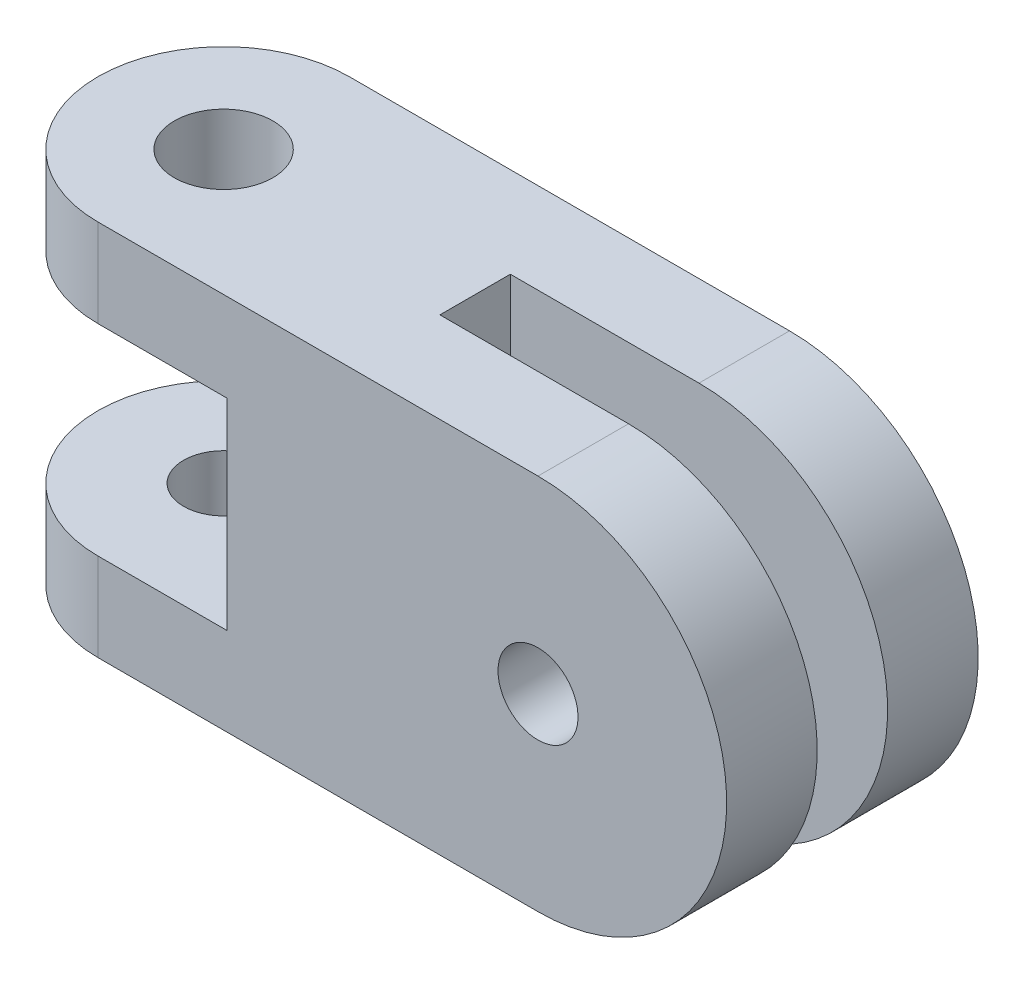
ISO-10303-21;
HEADER;
FILE_DESCRIPTION(('STEP AP214'),'2;1');
FILE_NAME('part.step','',(''),(''),'','','');
FILE_SCHEMA(('AUTOMOTIVE_DESIGN { 1 0 10303 214 1 1 1 1 }'));
ENDSEC;
DATA;
#1=APPLICATION_CONTEXT('core data for automotive mechanical design processes');
#2=APPLICATION_PROTOCOL_DEFINITION('international standard','automotive_design',2000,#1);
#3=PRODUCT_CONTEXT('',#1,'mechanical');
#4=PRODUCT('Part','Part','',(#3));
#5=PRODUCT_RELATED_PRODUCT_CATEGORY('part','',(#4));
#6=PRODUCT_DEFINITION_FORMATION('','',#4);
#7=PRODUCT_DEFINITION_CONTEXT('part definition',#1,'design');
#8=PRODUCT_DEFINITION('design','',#6,#7);
#9=PRODUCT_DEFINITION_SHAPE('','',#8);
#10=(LENGTH_UNIT() NAMED_UNIT(*) SI_UNIT(.MILLI.,.METRE.));
#11=(NAMED_UNIT(*) PLANE_ANGLE_UNIT() SI_UNIT($,.RADIAN.));
#12=(NAMED_UNIT(*) SI_UNIT($,.STERADIAN.) SOLID_ANGLE_UNIT());
#13=UNCERTAINTY_MEASURE_WITH_UNIT(LENGTH_MEASURE(1.E-05),#10,'distance_accuracy_value','');
#14=(GEOMETRIC_REPRESENTATION_CONTEXT(3) GLOBAL_UNCERTAINTY_ASSIGNED_CONTEXT((#13)) GLOBAL_UNIT_ASSIGNED_CONTEXT((#10,
#11,#12)) REPRESENTATION_CONTEXT('',''));
#15=CARTESIAN_POINT('',(0.,0.,0.));
#16=DIRECTION('',(0.,0.,1.));
#17=DIRECTION('',(1.,0.,0.));
#18=AXIS2_PLACEMENT_3D('',#15,#16,#17);
#19=CARTESIAN_POINT('',(6.35,0.,-38.1));
#20=DIRECTION('',(0.,0.,1.));
#21=DIRECTION('',(1.,0.,0.));
#22=AXIS2_PLACEMENT_3D('',#19,#20,#21);
#23=CYLINDRICAL_SURFACE('',#22,9.525);
#24=DIRECTION('',(0.,0.,1.));
#25=VECTOR('',#24,1.);
#26=CARTESIAN_POINT('',(6.35,9.525,-38.1));
#27=LINE('',#26,#25);
#28=CARTESIAN_POINT('',(6.35,9.525,-6.35));
#29=VERTEX_POINT('',#28);
#30=CARTESIAN_POINT('',(6.35,9.525,-1.778));
#31=VERTEX_POINT('',#30);
#32=EDGE_CURVE('E192',#29,#31,#27,.T.);
#33=ORIENTED_EDGE('',*,*,#32,.T.);
#34=CARTESIAN_POINT('',(6.35,0.,-1.778));
#35=DIRECTION('',(0.,0.,1.));
#36=DIRECTION('',(1.,0.,0.));
#37=AXIS2_PLACEMENT_3D('',#34,#35,#36);
#38=CIRCLE('',#37,9.525);
#39=CARTESIAN_POINT('',(6.35,-9.525,-1.778));
#40=VERTEX_POINT('',#39);
#41=EDGE_CURVE('E254',#40,#31,#38,.T.);
#42=ORIENTED_EDGE('',*,*,#41,.F.);
#43=DIRECTION('',(0.,0.,1.));
#44=VECTOR('',#43,1.);
#45=CARTESIAN_POINT('',(6.35,-9.525,-38.1));
#46=LINE('',#45,#44);
#47=CARTESIAN_POINT('',(6.35,-9.525,-6.35));
#48=VERTEX_POINT('',#47);
#49=EDGE_CURVE('E199',#48,#40,#46,.T.);
#50=ORIENTED_EDGE('',*,*,#49,.F.);
#51=CARTESIAN_POINT('',(6.35,0.,-6.35));
#52=DIRECTION('',(0.,0.,1.));
#53=DIRECTION('',(1.,0.,0.));
#54=AXIS2_PLACEMENT_3D('',#51,#52,#53);
#55=CIRCLE('',#54,9.525);
#56=EDGE_CURVE('E188',#29,#48,#55,.F.);
#57=ORIENTED_EDGE('',*,*,#56,.F.);
#58=EDGE_LOOP('',(#33,#42,#50,#57));
#59=FACE_BOUND('',#58,.T.);
#60=ADVANCED_FACE('F35',(#59),#23,.T.);
#61=CARTESIAN_POINT('',(0.,9.525,-6.35));
#62=DIRECTION('',(0.,0.,1.));
#63=DIRECTION('',(1.,0.,0.));
#64=AXIS2_PLACEMENT_3D('',#61,#62,#63);
#65=PLANE('',#64);
#66=CARTESIAN_POINT('',(6.35,0.,-6.35));
#67=DIRECTION('',(0.,0.,-1.));
#68=DIRECTION('',(-1.,0.,0.));
#69=AXIS2_PLACEMENT_3D('',#66,#67,#68);
#70=CIRCLE('',#69,2.48919999999999);
#71=CARTESIAN_POINT('',(3.86080000000001,0.,-6.35));
#72=VERTEX_POINT('',#71);
#73=EDGE_CURVE('E267',#72,#72,#70,.T.);
#74=ORIENTED_EDGE('',*,*,#73,.F.);
#75=EDGE_LOOP('',(#74));
#76=FACE_BOUND('',#75,.T.);
#77=DIRECTION('',(-1.,0.,0.));
#78=VECTOR('',#77,1.);
#79=CARTESIAN_POINT('',(-9.351499966,-5.08,-6.35));
#80=LINE('',#79,#78);
#81=CARTESIAN_POINT('',(-9.351499966,-5.08,-6.35));
#82=VERTEX_POINT('',#81);
#83=CARTESIAN_POINT('',(-15.875,-5.08,-6.35));
#84=VERTEX_POINT('',#83);
#85=EDGE_CURVE('E172',#82,#84,#80,.T.);
#86=ORIENTED_EDGE('',*,*,#85,.F.);
#87=DIRECTION('',(0.,1.,0.));
#88=VECTOR('',#87,1.);
#89=CARTESIAN_POINT('',(-9.351499966,-5.08,-6.35));
#90=LINE('',#89,#88);
#91=CARTESIAN_POINT('',(-9.351499966,5.08,-6.35));
#92=VERTEX_POINT('',#91);
#93=EDGE_CURVE('E183',#82,#92,#90,.T.);
#94=ORIENTED_EDGE('',*,*,#93,.T.);
#95=DIRECTION('',(-1.,0.,0.));
#96=VECTOR('',#95,1.);
#97=CARTESIAN_POINT('',(-9.351499966,5.08,-6.35));
#98=LINE('',#97,#96);
#99=CARTESIAN_POINT('',(-15.875,5.08,-6.35));
#100=VERTEX_POINT('',#99);
#101=EDGE_CURVE('E166',#92,#100,#98,.T.);
#102=ORIENTED_EDGE('',*,*,#101,.T.);
#103=DIRECTION('',(0.,-1.,0.));
#104=VECTOR('',#103,1.);
#105=CARTESIAN_POINT('',(-15.875,9.525,-6.35));
#106=LINE('',#105,#104);
#107=CARTESIAN_POINT('',(-15.875,9.525,-6.35));
#108=VERTEX_POINT('',#107);
#109=EDGE_CURVE('E11',#108,#100,#106,.T.);
#110=ORIENTED_EDGE('',*,*,#109,.F.);
#111=DIRECTION('',(-1.,0.,0.));
#112=VECTOR('',#111,1.);
#113=CARTESIAN_POINT('',(0.,9.525,-6.35));
#114=LINE('',#113,#112);
#115=EDGE_CURVE('E201',#29,#108,#114,.T.);
#116=ORIENTED_EDGE('',*,*,#115,.F.);
#117=ORIENTED_EDGE('',*,*,#56,.T.);
#118=DIRECTION('',(-1.,0.,0.));
#119=VECTOR('',#118,1.);
#120=CARTESIAN_POINT('',(0.,-9.525,-6.35));
#121=LINE('',#120,#119);
#122=CARTESIAN_POINT('',(-15.875,-9.525,-6.35));
#123=VERTEX_POINT('',#122);
#124=EDGE_CURVE('E191',#48,#123,#121,.T.);
#125=ORIENTED_EDGE('',*,*,#124,.T.);
#126=EDGE_CURVE('E43',#84,#123,#106,.T.);
#127=ORIENTED_EDGE('',*,*,#126,.F.);
#128=EDGE_LOOP('',(#86,#94,#102,#110,#116,#117,#125,#127));
#129=FACE_BOUND('',#128,.T.);
#130=ADVANCED_FACE('F37',(#76,#129),#65,.F.);
#131=CARTESIAN_POINT('',(-15.875,9.525,0.));
#132=DIRECTION('',(0.,-1.,0.));
#133=DIRECTION('',(0.,0.,-1.));
#134=AXIS2_PLACEMENT_3D('',#131,#132,#133);
#135=CYLINDRICAL_SURFACE('',#134,6.35);
#136=CARTESIAN_POINT('',(-15.875,-5.08,0.));
#137=DIRECTION('',(0.,1.,0.));
#138=DIRECTION('',(0.,0.,1.));
#139=AXIS2_PLACEMENT_3D('',#136,#137,#138);
#140=CIRCLE('',#139,6.35);
#141=CARTESIAN_POINT('',(-15.875,-5.08,6.35));
#142=VERTEX_POINT('',#141);
#143=EDGE_CURVE('E163',#84,#142,#140,.T.);
#144=ORIENTED_EDGE('',*,*,#143,.F.);
#145=ORIENTED_EDGE('',*,*,#126,.T.);
#146=CARTESIAN_POINT('',(-15.875,-9.525,0.));
#147=DIRECTION('',(0.,1.,0.));
#148=DIRECTION('',(0.,0.,1.));
#149=AXIS2_PLACEMENT_3D('',#146,#147,#148);
#150=CIRCLE('',#149,6.35);
#151=CARTESIAN_POINT('',(-15.875,-9.525,6.35));
#152=VERTEX_POINT('',#151);
#153=EDGE_CURVE('E212',#123,#152,#150,.T.);
#154=ORIENTED_EDGE('',*,*,#153,.T.);
#155=DIRECTION('',(0.,-1.,0.));
#156=VECTOR('',#155,1.);
#157=CARTESIAN_POINT('',(-15.875,9.525,6.35));
#158=LINE('',#157,#156);
#159=EDGE_CURVE('E209',#142,#152,#158,.T.);
#160=ORIENTED_EDGE('',*,*,#159,.F.);
#161=EDGE_LOOP('',(#144,#145,#154,#160));
#162=FACE_BOUND('',#161,.T.);
#163=ADVANCED_FACE('F230',(#162),#135,.T.);
#164=CARTESIAN_POINT('',(0.,9.525,6.35));
#165=DIRECTION('',(0.,0.,-1.));
#166=DIRECTION('',(-1.,0.,0.));
#167=AXIS2_PLACEMENT_3D('',#164,#165,#166);
#168=PLANE('',#167);
#169=CARTESIAN_POINT('',(6.35,0.,6.35));
#170=DIRECTION('',(0.,0.,-1.));
#171=DIRECTION('',(-1.,0.,0.));
#172=AXIS2_PLACEMENT_3D('',#169,#170,#171);
#173=CIRCLE('',#172,2.0193);
#174=CARTESIAN_POINT('',(4.3307,0.,6.35));
#175=VERTEX_POINT('',#174);
#176=EDGE_CURVE('E270',#175,#175,#173,.T.);
#177=ORIENTED_EDGE('',*,*,#176,.T.);
#178=EDGE_LOOP('',(#177));
#179=FACE_BOUND('',#178,.T.);
#180=DIRECTION('',(1.,0.,0.));
#181=VECTOR('',#180,1.);
#182=CARTESIAN_POINT('',(-15.875,-5.08,6.35));
#183=LINE('',#182,#181);
#184=CARTESIAN_POINT('',(-9.351499966,-5.08,6.35));
#185=VERTEX_POINT('',#184);
#186=EDGE_CURVE('E165',#142,#185,#183,.T.);
#187=ORIENTED_EDGE('',*,*,#186,.F.);
#188=ORIENTED_EDGE('',*,*,#159,.T.);
#189=DIRECTION('',(1.,0.,0.));
#190=VECTOR('',#189,1.);
#191=CARTESIAN_POINT('',(0.,-9.525,6.35));
#192=LINE('',#191,#190);
#193=CARTESIAN_POINT('',(6.35,-9.525,6.35));
#194=VERTEX_POINT('',#193);
#195=EDGE_CURVE('E204',#152,#194,#192,.T.);
#196=ORIENTED_EDGE('',*,*,#195,.T.);
#197=CARTESIAN_POINT('',(6.35,0.,6.35));
#198=DIRECTION('',(0.,0.,1.));
#199=DIRECTION('',(1.,0.,0.));
#200=AXIS2_PLACEMENT_3D('',#197,#198,#199);
#201=CIRCLE('',#200,9.525);
#202=CARTESIAN_POINT('',(6.35,9.525,6.35));
#203=VERTEX_POINT('',#202);
#204=EDGE_CURVE('E186',#194,#203,#201,.T.);
#205=ORIENTED_EDGE('',*,*,#204,.T.);
#206=DIRECTION('',(1.,0.,0.));
#207=VECTOR('',#206,1.);
#208=CARTESIAN_POINT('',(0.,9.525,6.35));
#209=LINE('',#208,#207);
#210=CARTESIAN_POINT('',(-15.875,9.525,6.35));
#211=VERTEX_POINT('',#210);
#212=EDGE_CURVE('E206',#211,#203,#209,.T.);
#213=ORIENTED_EDGE('',*,*,#212,.F.);
#214=CARTESIAN_POINT('',(-15.875,5.08,6.35));
#215=VERTEX_POINT('',#214);
#216=EDGE_CURVE('E216',#211,#215,#158,.T.);
#217=ORIENTED_EDGE('',*,*,#216,.T.);
#218=DIRECTION('',(1.,0.,0.));
#219=VECTOR('',#218,1.);
#220=CARTESIAN_POINT('',(-15.875,5.08,6.35));
#221=LINE('',#220,#219);
#222=CARTESIAN_POINT('',(-9.351499966,5.08,6.35));
#223=VERTEX_POINT('',#222);
#224=EDGE_CURVE('E177',#215,#223,#221,.T.);
#225=ORIENTED_EDGE('',*,*,#224,.T.);
#226=DIRECTION('',(0.,1.,0.));
#227=VECTOR('',#226,1.);
#228=CARTESIAN_POINT('',(-9.351499966,-5.08,6.35));
#229=LINE('',#228,#227);
#230=EDGE_CURVE('E174',#185,#223,#229,.T.);
#231=ORIENTED_EDGE('',*,*,#230,.F.);
#232=EDGE_LOOP('',(#187,#188,#196,#205,#213,#217,#225,#231));
#233=FACE_BOUND('',#232,.T.);
#234=ADVANCED_FACE('F223',(#179,#233),#168,.F.);
#235=ORIENTED_EDGE('',*,*,#109,.T.);
#236=CARTESIAN_POINT('',(-15.875,5.08,0.));
#237=DIRECTION('',(0.,1.,0.));
#238=DIRECTION('',(0.,0.,1.));
#239=AXIS2_PLACEMENT_3D('',#236,#237,#238);
#240=CIRCLE('',#239,6.35);
#241=EDGE_CURVE('E162',#100,#215,#240,.T.);
#242=ORIENTED_EDGE('',*,*,#241,.T.);
#243=ORIENTED_EDGE('',*,*,#216,.F.);
#244=CARTESIAN_POINT('',(-15.875,9.525,0.));
#245=DIRECTION('',(0.,1.,0.));
#246=DIRECTION('',(0.,0.,1.));
#247=AXIS2_PLACEMENT_3D('',#244,#245,#246);
#248=CIRCLE('',#247,6.35);
#249=EDGE_CURVE('E203',#108,#211,#248,.T.);
#250=ORIENTED_EDGE('',*,*,#249,.F.);
#251=EDGE_LOOP('',(#235,#242,#243,#250));
#252=FACE_BOUND('',#251,.T.);
#253=ADVANCED_FACE('F242',(#252),#135,.T.);
#254=CARTESIAN_POINT('',(-15.875,9.525,0.));
#255=DIRECTION('',(0.,1.,0.));
#256=DIRECTION('',(0.,0.,1.));
#257=AXIS2_PLACEMENT_3D('',#254,#255,#256);
#258=PLANE('',#257);
#259=DIRECTION('',(-1.,0.,0.));
#260=VECTOR('',#259,1.);
#261=CARTESIAN_POINT('',(6.35,9.525,1.778));
#262=LINE('',#261,#260);
#263=CARTESIAN_POINT('',(6.35,9.525,1.778));
#264=VERTEX_POINT('',#263);
#265=CARTESIAN_POINT('',(-3.175,9.525,1.778));
#266=VERTEX_POINT('',#265);
#267=EDGE_CURVE('E150',#264,#266,#262,.T.);
#268=ORIENTED_EDGE('',*,*,#267,.T.);
#269=DIRECTION('',(0.,0.,-1.));
#270=VECTOR('',#269,1.);
#271=CARTESIAN_POINT('',(-3.175,9.525,1.778));
#272=LINE('',#271,#270);
#273=CARTESIAN_POINT('',(-3.175,9.525,-1.778));
#274=VERTEX_POINT('',#273);
#275=EDGE_CURVE('E130',#266,#274,#272,.T.);
#276=ORIENTED_EDGE('',*,*,#275,.T.);
#277=DIRECTION('',(-1.,0.,0.));
#278=VECTOR('',#277,1.);
#279=CARTESIAN_POINT('',(6.35,9.525,-1.778));
#280=LINE('',#279,#278);
#281=EDGE_CURVE('E134',#31,#274,#280,.T.);
#282=ORIENTED_EDGE('',*,*,#281,.F.);
#283=ORIENTED_EDGE('',*,*,#32,.F.);
#284=ORIENTED_EDGE('',*,*,#115,.T.);
#285=ORIENTED_EDGE('',*,*,#249,.T.);
#286=ORIENTED_EDGE('',*,*,#212,.T.);
#287=EDGE_CURVE('E198',#264,#203,#27,.T.);
#288=ORIENTED_EDGE('',*,*,#287,.F.);
#289=EDGE_LOOP('',(#268,#276,#282,#283,#284,#285,#286,#288));
#290=FACE_BOUND('',#289,.T.);
#291=CARTESIAN_POINT('',(-15.875,9.525,0.));
#292=DIRECTION('',(0.,1.,0.));
#293=DIRECTION('',(0.,0.,1.));
#294=AXIS2_PLACEMENT_3D('',#291,#292,#293);
#295=CIRCLE('',#294,2.48919999999999);
#296=CARTESIAN_POINT('',(-15.875,9.525,2.48919999999999));
#297=VERTEX_POINT('',#296);
#298=EDGE_CURVE('E145',#297,#297,#295,.T.);
#299=ORIENTED_EDGE('',*,*,#298,.F.);
#300=EDGE_LOOP('',(#299));
#301=FACE_BOUND('',#300,.T.);
#302=ADVANCED_FACE('F236',(#290,#301),#258,.T.);
#303=CARTESIAN_POINT('',(-15.875,-9.525,0.));
#304=DIRECTION('',(0.,1.,0.));
#305=DIRECTION('',(0.,0.,1.));
#306=AXIS2_PLACEMENT_3D('',#303,#304,#305);
#307=PLANE('',#306);
#308=CARTESIAN_POINT('',(-15.875,-9.525,0.));
#309=DIRECTION('',(0.,1.,0.));
#310=DIRECTION('',(0.,0.,1.));
#311=AXIS2_PLACEMENT_3D('',#308,#309,#310);
#312=CIRCLE('',#311,2.0193);
#313=CARTESIAN_POINT('',(-15.875,-9.525,2.0193));
#314=VERTEX_POINT('',#313);
#315=EDGE_CURVE('E159',#314,#314,#312,.T.);
#316=ORIENTED_EDGE('',*,*,#315,.T.);
#317=EDGE_LOOP('',(#316));
#318=FACE_BOUND('',#317,.T.);
#319=DIRECTION('',(0.,0.,-1.));
#320=VECTOR('',#319,1.);
#321=CARTESIAN_POINT('',(-3.175,-9.525,1.778));
#322=LINE('',#321,#320);
#323=CARTESIAN_POINT('',(-3.175,-9.525,1.778));
#324=VERTEX_POINT('',#323);
#325=CARTESIAN_POINT('',(-3.175,-9.525,-1.778));
#326=VERTEX_POINT('',#325);
#327=EDGE_CURVE('E128',#324,#326,#322,.T.);
#328=ORIENTED_EDGE('',*,*,#327,.F.);
#329=DIRECTION('',(1.,0.,0.));
#330=VECTOR('',#329,1.);
#331=CARTESIAN_POINT('',(-3.175,-9.525,1.778));
#332=LINE('',#331,#330);
#333=CARTESIAN_POINT('',(6.35,-9.525,1.778));
#334=VERTEX_POINT('',#333);
#335=EDGE_CURVE('E133',#324,#334,#332,.T.);
#336=ORIENTED_EDGE('',*,*,#335,.T.);
#337=EDGE_CURVE('E195',#334,#194,#46,.T.);
#338=ORIENTED_EDGE('',*,*,#337,.T.);
#339=ORIENTED_EDGE('',*,*,#195,.F.);
#340=ORIENTED_EDGE('',*,*,#153,.F.);
#341=ORIENTED_EDGE('',*,*,#124,.F.);
#342=ORIENTED_EDGE('',*,*,#49,.T.);
#343=DIRECTION('',(1.,0.,0.));
#344=VECTOR('',#343,1.);
#345=CARTESIAN_POINT('',(-3.175,-9.525,-1.778));
#346=LINE('',#345,#344);
#347=EDGE_CURVE('E50',#326,#40,#346,.T.);
#348=ORIENTED_EDGE('',*,*,#347,.F.);
#349=EDGE_LOOP('',(#328,#336,#338,#339,#340,#341,#342,#348));
#350=FACE_BOUND('',#349,.T.);
#351=ADVANCED_FACE('F143',(#318,#350),#307,.F.);
#352=CARTESIAN_POINT('',(6.35,0.,1.778));
#353=DIRECTION('',(0.,0.,1.));
#354=DIRECTION('',(1.,0.,0.));
#355=AXIS2_PLACEMENT_3D('',#352,#353,#354);
#356=CIRCLE('',#355,9.525);
#357=EDGE_CURVE('E139',#334,#264,#356,.T.);
#358=ORIENTED_EDGE('',*,*,#357,.T.);
#359=ORIENTED_EDGE('',*,*,#287,.T.);
#360=ORIENTED_EDGE('',*,*,#204,.F.);
#361=ORIENTED_EDGE('',*,*,#337,.F.);
#362=EDGE_LOOP('',(#358,#359,#360,#361));
#363=FACE_BOUND('',#362,.T.);
#364=ADVANCED_FACE('F233',(#363),#23,.T.);
#365=CARTESIAN_POINT('',(-9.351499966,-5.08,6.35));
#366=DIRECTION('',(1.,0.,0.));
#367=DIRECTION('',(0.,0.,-1.));
#368=AXIS2_PLACEMENT_3D('',#365,#366,#367);
#369=PLANE('',#368);
#370=DIRECTION('',(0.,0.,-1.));
#371=VECTOR('',#370,1.);
#372=CARTESIAN_POINT('',(-9.351499966,5.08,6.35));
#373=LINE('',#372,#371);
#374=EDGE_CURVE('E58',#223,#92,#373,.T.);
#375=ORIENTED_EDGE('',*,*,#374,.T.);
#376=ORIENTED_EDGE('',*,*,#93,.F.);
#377=DIRECTION('',(0.,0.,-1.));
#378=VECTOR('',#377,1.);
#379=CARTESIAN_POINT('',(-9.351499966,-5.08,6.35));
#380=LINE('',#379,#378);
#381=EDGE_CURVE('E169',#185,#82,#380,.T.);
#382=ORIENTED_EDGE('',*,*,#381,.F.);
#383=ORIENTED_EDGE('',*,*,#230,.T.);
#384=EDGE_LOOP('',(#375,#376,#382,#383));
#385=FACE_BOUND('',#384,.T.);
#386=ADVANCED_FACE('F247',(#385),#369,.F.);
#387=CARTESIAN_POINT('',(-15.875,-5.08,0.));
#388=DIRECTION('',(0.,1.,0.));
#389=DIRECTION('',(0.,0.,1.));
#390=AXIS2_PLACEMENT_3D('',#387,#388,#389);
#391=PLANE('',#390);
#392=ORIENTED_EDGE('',*,*,#143,.T.);
#393=ORIENTED_EDGE('',*,*,#186,.T.);
#394=ORIENTED_EDGE('',*,*,#381,.T.);
#395=ORIENTED_EDGE('',*,*,#85,.T.);
#396=EDGE_LOOP('',(#392,#393,#394,#395));
#397=FACE_BOUND('',#396,.T.);
#398=CARTESIAN_POINT('',(-15.875,-5.08,0.));
#399=DIRECTION('',(0.,1.,0.));
#400=DIRECTION('',(0.,0.,1.));
#401=AXIS2_PLACEMENT_3D('',#398,#399,#400);
#402=CIRCLE('',#401,2.01929999999999);
#403=CARTESIAN_POINT('',(-15.875,-5.08,2.01929999999999));
#404=VERTEX_POINT('',#403);
#405=EDGE_CURVE('E156',#404,#404,#402,.T.);
#406=ORIENTED_EDGE('',*,*,#405,.F.);
#407=EDGE_LOOP('',(#406));
#408=FACE_BOUND('',#407,.T.);
#409=ADVANCED_FACE('F249',(#397,#408),#391,.T.);
#410=CARTESIAN_POINT('',(-15.875,5.08,0.));
#411=DIRECTION('',(0.,1.,0.));
#412=DIRECTION('',(0.,0.,1.));
#413=AXIS2_PLACEMENT_3D('',#410,#411,#412);
#414=PLANE('',#413);
#415=CARTESIAN_POINT('',(-15.875,5.08,0.));
#416=DIRECTION('',(0.,1.,0.));
#417=DIRECTION('',(0.,0.,1.));
#418=AXIS2_PLACEMENT_3D('',#415,#416,#417);
#419=CIRCLE('',#418,2.48919999999999);
#420=CARTESIAN_POINT('',(-15.875,5.08,2.48919999999999));
#421=VERTEX_POINT('',#420);
#422=EDGE_CURVE('E148',#421,#421,#419,.T.);
#423=ORIENTED_EDGE('',*,*,#422,.T.);
#424=EDGE_LOOP('',(#423));
#425=FACE_BOUND('',#424,.T.);
#426=ORIENTED_EDGE('',*,*,#241,.F.);
#427=ORIENTED_EDGE('',*,*,#101,.F.);
#428=ORIENTED_EDGE('',*,*,#374,.F.);
#429=ORIENTED_EDGE('',*,*,#224,.F.);
#430=EDGE_LOOP('',(#426,#427,#428,#429));
#431=FACE_BOUND('',#430,.T.);
#432=ADVANCED_FACE('F243',(#425,#431),#414,.F.);
#433=CARTESIAN_POINT('',(-15.875,-5.08,0.));
#434=DIRECTION('',(0.,1.,0.));
#435=DIRECTION('',(0.,0.,1.));
#436=AXIS2_PLACEMENT_3D('',#433,#434,#435);
#437=CYLINDRICAL_SURFACE('',#436,2.01929999999999);
#438=ORIENTED_EDGE('',*,*,#315,.F.);
#439=EDGE_LOOP('',(#438));
#440=FACE_BOUND('',#439,.T.);
#441=ORIENTED_EDGE('',*,*,#405,.T.);
#442=EDGE_LOOP('',(#441));
#443=FACE_BOUND('',#442,.T.);
#444=ADVANCED_FACE('F353',(#440,#443),#437,.F.);
#445=CARTESIAN_POINT('',(-15.875,9.525,0.));
#446=DIRECTION('',(0.,1.,0.));
#447=DIRECTION('',(0.,0.,1.));
#448=AXIS2_PLACEMENT_3D('',#445,#446,#447);
#449=CYLINDRICAL_SURFACE('',#448,2.48919999999999);
#450=ORIENTED_EDGE('',*,*,#298,.T.);
#451=EDGE_LOOP('',(#450));
#452=FACE_BOUND('',#451,.T.);
#453=ORIENTED_EDGE('',*,*,#422,.F.);
#454=EDGE_LOOP('',(#453));
#455=FACE_BOUND('',#454,.T.);
#456=ADVANCED_FACE('F289',(#452,#455),#449,.F.);
#457=CARTESIAN_POINT('',(-3.175,0.,1.778));
#458=DIRECTION('',(1.,0.,0.));
#459=DIRECTION('',(0.,1.,0.));
#460=AXIS2_PLACEMENT_3D('',#457,#458,#459);
#461=PLANE('',#460);
#462=DIRECTION('',(0.,-1.,0.));
#463=VECTOR('',#462,1.);
#464=CARTESIAN_POINT('',(-3.175,0.,-1.778));
#465=LINE('',#464,#463);
#466=EDGE_CURVE('E258',#274,#326,#465,.T.);
#467=ORIENTED_EDGE('',*,*,#466,.F.);
#468=ORIENTED_EDGE('',*,*,#275,.F.);
#469=DIRECTION('',(0.,-1.,0.));
#470=VECTOR('',#469,1.);
#471=CARTESIAN_POINT('',(-3.175,9.525,1.778));
#472=LINE('',#471,#470);
#473=EDGE_CURVE('E124',#266,#324,#472,.T.);
#474=ORIENTED_EDGE('',*,*,#473,.T.);
#475=ORIENTED_EDGE('',*,*,#327,.T.);
#476=EDGE_LOOP('',(#467,#468,#474,#475));
#477=FACE_BOUND('',#476,.T.);
#478=ADVANCED_FACE('F126',(#477),#461,.T.);
#479=CARTESIAN_POINT('',(6.35,0.,1.778));
#480=DIRECTION('',(0.,0.,1.));
#481=DIRECTION('',(1.,0.,0.));
#482=AXIS2_PLACEMENT_3D('',#479,#480,#481);
#483=PLANE('',#482);
#484=CARTESIAN_POINT('',(6.35,0.,1.778));
#485=DIRECTION('',(0.,0.,-1.));
#486=DIRECTION('',(-1.,0.,0.));
#487=AXIS2_PLACEMENT_3D('',#484,#485,#486);
#488=CIRCLE('',#487,2.01929999999999);
#489=CARTESIAN_POINT('',(4.33070000000001,0.,1.778));
#490=VERTEX_POINT('',#489);
#491=EDGE_CURVE('E273',#490,#490,#488,.T.);
#492=ORIENTED_EDGE('',*,*,#491,.F.);
#493=EDGE_LOOP('',(#492));
#494=FACE_BOUND('',#493,.T.);
#495=ORIENTED_EDGE('',*,*,#473,.F.);
#496=ORIENTED_EDGE('',*,*,#267,.F.);
#497=ORIENTED_EDGE('',*,*,#357,.F.);
#498=ORIENTED_EDGE('',*,*,#335,.F.);
#499=EDGE_LOOP('',(#495,#496,#497,#498));
#500=FACE_BOUND('',#499,.T.);
#501=ADVANCED_FACE('F137',(#494,#500),#483,.F.);
#502=CARTESIAN_POINT('',(6.35,0.,-1.778));
#503=DIRECTION('',(0.,0.,1.));
#504=DIRECTION('',(1.,0.,0.));
#505=AXIS2_PLACEMENT_3D('',#502,#503,#504);
#506=PLANE('',#505);
#507=CARTESIAN_POINT('',(6.35,0.,-1.778));
#508=DIRECTION('',(0.,0.,1.));
#509=DIRECTION('',(1.,0.,0.));
#510=AXIS2_PLACEMENT_3D('',#507,#508,#509);
#511=CIRCLE('',#510,2.48919999999999);
#512=CARTESIAN_POINT('',(8.83919999999999,0.,-1.778));
#513=VERTEX_POINT('',#512);
#514=EDGE_CURVE('E262',#513,#513,#511,.T.);
#515=ORIENTED_EDGE('',*,*,#514,.F.);
#516=EDGE_LOOP('',(#515));
#517=FACE_BOUND('',#516,.T.);
#518=ORIENTED_EDGE('',*,*,#466,.T.);
#519=ORIENTED_EDGE('',*,*,#347,.T.);
#520=ORIENTED_EDGE('',*,*,#41,.T.);
#521=ORIENTED_EDGE('',*,*,#281,.T.);
#522=EDGE_LOOP('',(#518,#519,#520,#521));
#523=FACE_BOUND('',#522,.T.);
#524=ADVANCED_FACE('F280',(#517,#523),#506,.T.);
#525=CARTESIAN_POINT('',(6.35,0.,-6.35));
#526=DIRECTION('',(0.,0.,-1.));
#527=DIRECTION('',(-1.,0.,0.));
#528=AXIS2_PLACEMENT_3D('',#525,#526,#527);
#529=CYLINDRICAL_SURFACE('',#528,2.48919999999999);
#530=ORIENTED_EDGE('',*,*,#514,.T.);
#531=EDGE_LOOP('',(#530));
#532=FACE_BOUND('',#531,.T.);
#533=ORIENTED_EDGE('',*,*,#73,.T.);
#534=EDGE_LOOP('',(#533));
#535=FACE_BOUND('',#534,.T.);
#536=ADVANCED_FACE('F286',(#532,#535),#529,.F.);
#537=CARTESIAN_POINT('',(6.35,0.,1.778));
#538=DIRECTION('',(0.,0.,-1.));
#539=DIRECTION('',(-1.,0.,0.));
#540=AXIS2_PLACEMENT_3D('',#537,#538,#539);
#541=CYLINDRICAL_SURFACE('',#540,2.01929999999999);
#542=ORIENTED_EDGE('',*,*,#176,.F.);
#543=EDGE_LOOP('',(#542));
#544=FACE_BOUND('',#543,.T.);
#545=ORIENTED_EDGE('',*,*,#491,.T.);
#546=EDGE_LOOP('',(#545));
#547=FACE_BOUND('',#546,.T.);
#548=ADVANCED_FACE('F277',(#544,#547),#541,.F.);
#549=CLOSED_SHELL('',(#60,#130,#163,#234,#253,#302,#351,#364,#386,#409,#432,#444,#456,#478,#501,
#524,#536,#548));
#550=MANIFOLD_SOLID_BREP('B2',#549);
#551=ADVANCED_BREP_SHAPE_REPRESENTATION('',(#18,#550),#14);
#552=SHAPE_DEFINITION_REPRESENTATION(#9,#551);
ENDSEC;
END-ISO-10303-21;
